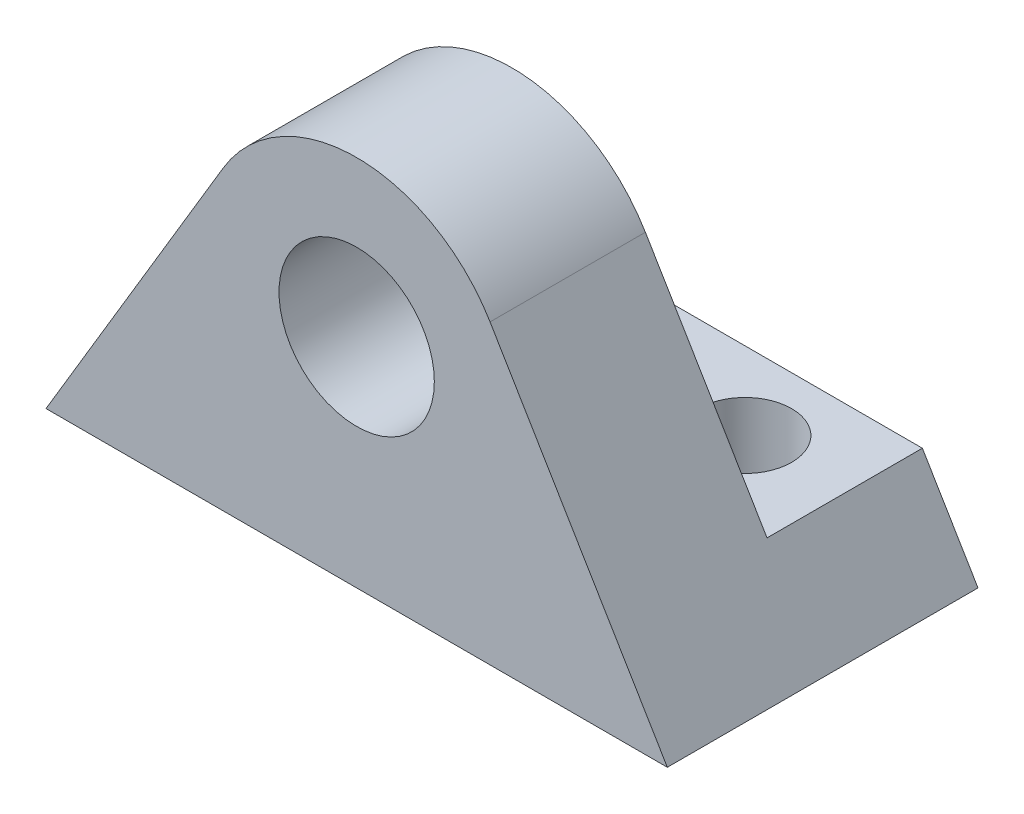
ISO-10303-21;
HEADER;
FILE_DESCRIPTION(('STEP AP214'),'2;1');
FILE_NAME('part.step','',(''),(''),'','','');
FILE_SCHEMA(('AUTOMOTIVE_DESIGN { 1 0 10303 214 1 1 1 1 }'));
ENDSEC;
DATA;
#1=APPLICATION_CONTEXT('core data for automotive mechanical design processes');
#2=APPLICATION_PROTOCOL_DEFINITION('international standard','automotive_design',2000,#1);
#3=PRODUCT_CONTEXT('',#1,'mechanical');
#4=PRODUCT('Part','Part','',(#3));
#5=PRODUCT_RELATED_PRODUCT_CATEGORY('part','',(#4));
#6=PRODUCT_DEFINITION_FORMATION('','',#4);
#7=PRODUCT_DEFINITION_CONTEXT('part definition',#1,'design');
#8=PRODUCT_DEFINITION('design','',#6,#7);
#9=PRODUCT_DEFINITION_SHAPE('','',#8);
#10=(LENGTH_UNIT() NAMED_UNIT(*) SI_UNIT(.MILLI.,.METRE.));
#11=(NAMED_UNIT(*) PLANE_ANGLE_UNIT() SI_UNIT($,.RADIAN.));
#12=(NAMED_UNIT(*) SI_UNIT($,.STERADIAN.) SOLID_ANGLE_UNIT());
#13=UNCERTAINTY_MEASURE_WITH_UNIT(LENGTH_MEASURE(1.E-05),#10,'distance_accuracy_value','');
#14=(GEOMETRIC_REPRESENTATION_CONTEXT(3) GLOBAL_UNCERTAINTY_ASSIGNED_CONTEXT((#13)) GLOBAL_UNIT_ASSIGNED_CONTEXT((#10,
#11,#12)) REPRESENTATION_CONTEXT('',''));
#15=CARTESIAN_POINT('',(0.,0.,0.));
#16=DIRECTION('',(0.,0.,1.));
#17=DIRECTION('',(1.,0.,0.));
#18=AXIS2_PLACEMENT_3D('',#15,#16,#17);
#19=CARTESIAN_POINT('',(12.7,8.89,6.35));
#20=DIRECTION('',(0.,0.,1.));
#21=DIRECTION('',(1.,0.,0.));
#22=AXIS2_PLACEMENT_3D('',#19,#20,#21);
#23=PLANE('',#22);
#24=DIRECTION('',(-0.512451592326178,-0.858716114628324,0.));
#25=VECTOR('',#24,1.);
#26=CARTESIAN_POINT('',(7.24715267211014,12.1440676112712,6.35));
#27=LINE('',#26,#25);
#28=CARTESIAN_POINT('',(7.24715267211014,12.1440676112712,6.35));
#29=VERTEX_POINT('',#28);
#30=CARTESIAN_POINT('',(0.,0.,6.35));
#31=VERTEX_POINT('',#30);
#32=EDGE_CURVE('E102',#29,#31,#27,.T.);
#33=ORIENTED_EDGE('',*,*,#32,.T.);
#34=DIRECTION('',(1.,0.,0.));
#35=VECTOR('',#34,1.);
#36=CARTESIAN_POINT('',(0.,0.,6.35));
#37=LINE('',#36,#35);
#38=CARTESIAN_POINT('',(25.4,0.,6.35));
#39=VERTEX_POINT('',#38);
#40=EDGE_CURVE('E95',#31,#39,#37,.T.);
#41=ORIENTED_EDGE('',*,*,#40,.T.);
#42=DIRECTION('',(-0.512451592326178,0.858716114628324,0.));
#43=VECTOR('',#42,1.);
#44=CARTESIAN_POINT('',(25.4,0.,6.35));
#45=LINE('',#44,#43);
#46=CARTESIAN_POINT('',(18.1528473278899,12.1440676112712,6.35));
#47=VERTEX_POINT('',#46);
#48=EDGE_CURVE('E99',#39,#47,#45,.T.);
#49=ORIENTED_EDGE('',*,*,#48,.T.);
#50=CARTESIAN_POINT('',(12.7,8.89,6.35));
#51=DIRECTION('',(0.,0.,1.));
#52=DIRECTION('',(1.,0.,0.));
#53=AXIS2_PLACEMENT_3D('',#50,#51,#52);
#54=CIRCLE('',#53,6.35);
#55=EDGE_CURVE('E64',#47,#29,#54,.T.);
#56=ORIENTED_EDGE('',*,*,#55,.T.);
#57=EDGE_LOOP('',(#33,#41,#49,#56));
#58=FACE_BOUND('',#57,.T.);
#59=CARTESIAN_POINT('',(12.7,8.89,6.35));
#60=DIRECTION('',(0.,0.,1.));
#61=DIRECTION('',(1.,0.,0.));
#62=AXIS2_PLACEMENT_3D('',#59,#60,#61);
#63=CIRCLE('',#62,3.17500000000001);
#64=CARTESIAN_POINT('',(15.875,8.89,6.35));
#65=VERTEX_POINT('',#64);
#66=EDGE_CURVE('E127',#65,#65,#63,.T.);
#67=ORIENTED_EDGE('',*,*,#66,.F.);
#68=EDGE_LOOP('',(#67));
#69=FACE_BOUND('',#68,.T.);
#70=ADVANCED_FACE('F45',(#58,#69),#23,.T.);
#71=CARTESIAN_POINT('',(12.7,8.89,-6.35));
#72=DIRECTION('',(0.,0.,1.));
#73=DIRECTION('',(1.,0.,0.));
#74=AXIS2_PLACEMENT_3D('',#71,#72,#73);
#75=PLANE('',#74);
#76=DIRECTION('',(-0.512451592326178,-0.858716114628324,0.));
#77=VECTOR('',#76,1.);
#78=CARTESIAN_POINT('',(7.24715267211014,12.1440676112712,-6.35));
#79=LINE('',#78,#77);
#80=CARTESIAN_POINT('',(2.27367407400734,3.81,-6.35));
#81=VERTEX_POINT('',#80);
#82=CARTESIAN_POINT('',(0.,0.,-6.35));
#83=VERTEX_POINT('',#82);
#84=EDGE_CURVE('E76',#81,#83,#79,.T.);
#85=ORIENTED_EDGE('',*,*,#84,.F.);
#86=DIRECTION('',(1.,0.,0.));
#87=VECTOR('',#86,1.);
#88=CARTESIAN_POINT('',(2.27367407400734,3.81,-6.35));
#89=LINE('',#88,#87);
#90=CARTESIAN_POINT('',(23.1263259259927,3.81,-6.35));
#91=VERTEX_POINT('',#90);
#92=EDGE_CURVE('E157',#81,#91,#89,.T.);
#93=ORIENTED_EDGE('',*,*,#92,.T.);
#94=DIRECTION('',(-0.512451592326178,0.858716114628324,0.));
#95=VECTOR('',#94,1.);
#96=CARTESIAN_POINT('',(25.4,0.,-6.35));
#97=LINE('',#96,#95);
#98=CARTESIAN_POINT('',(25.4,0.,-6.35));
#99=VERTEX_POINT('',#98);
#100=EDGE_CURVE('E130',#99,#91,#97,.T.);
#101=ORIENTED_EDGE('',*,*,#100,.F.);
#102=DIRECTION('',(1.,0.,0.));
#103=VECTOR('',#102,1.);
#104=CARTESIAN_POINT('',(0.,0.,-6.35));
#105=LINE('',#104,#103);
#106=EDGE_CURVE('E108',#83,#99,#105,.T.);
#107=ORIENTED_EDGE('',*,*,#106,.F.);
#108=EDGE_LOOP('',(#85,#93,#101,#107));
#109=FACE_BOUND('',#108,.T.);
#110=ADVANCED_FACE('F204',(#109),#75,.F.);
#111=CARTESIAN_POINT('',(7.24715267211014,12.1440676112712,6.35));
#112=DIRECTION('',(0.858716114628324,-0.512451592326177,0.));
#113=DIRECTION('',(0.512451592326178,0.858716114628324,0.));
#114=AXIS2_PLACEMENT_3D('',#111,#112,#113);
#115=PLANE('',#114);
#116=DIRECTION('',(-0.512451592326178,-0.858716114628324,0.));
#117=VECTOR('',#116,1.);
#118=CARTESIAN_POINT('',(7.24715267211014,12.1440676112712,0.));
#119=LINE('',#118,#117);
#120=CARTESIAN_POINT('',(7.24715267211014,12.1440676112712,0.));
#121=VERTEX_POINT('',#120);
#122=CARTESIAN_POINT('',(2.27367407400734,3.81,0.));
#123=VERTEX_POINT('',#122);
#124=EDGE_CURVE('E87',#121,#123,#119,.T.);
#125=ORIENTED_EDGE('',*,*,#124,.T.);
#126=DIRECTION('',(0.,0.,1.));
#127=VECTOR('',#126,1.);
#128=CARTESIAN_POINT('',(2.27367407400734,3.81,-6.35));
#129=LINE('',#128,#127);
#130=EDGE_CURVE('E152',#81,#123,#129,.T.);
#131=ORIENTED_EDGE('',*,*,#130,.F.);
#132=ORIENTED_EDGE('',*,*,#84,.T.);
#133=DIRECTION('',(0.,0.,-1.));
#134=VECTOR('',#133,1.);
#135=CARTESIAN_POINT('',(0.,0.,6.35));
#136=LINE('',#135,#134);
#137=EDGE_CURVE('E11',#31,#83,#136,.T.);
#138=ORIENTED_EDGE('',*,*,#137,.F.);
#139=ORIENTED_EDGE('',*,*,#32,.F.);
#140=DIRECTION('',(0.,0.,-1.));
#141=VECTOR('',#140,1.);
#142=CARTESIAN_POINT('',(7.24715267211014,12.1440676112712,6.35));
#143=LINE('',#142,#141);
#144=EDGE_CURVE('E121',#29,#121,#143,.T.);
#145=ORIENTED_EDGE('',*,*,#144,.T.);
#146=EDGE_LOOP('',(#125,#131,#132,#138,#139,#145));
#147=FACE_BOUND('',#146,.T.);
#148=ADVANCED_FACE('F47',(#147),#115,.F.);
#149=CARTESIAN_POINT('',(0.,0.,6.35));
#150=DIRECTION('',(0.,1.,0.));
#151=DIRECTION('',(0.,0.,1.));
#152=AXIS2_PLACEMENT_3D('',#149,#150,#151);
#153=PLANE('',#152);
#154=CARTESIAN_POINT('',(6.35,0.,-3.175));
#155=DIRECTION('',(0.,1.,0.));
#156=DIRECTION('',(0.,0.,1.));
#157=AXIS2_PLACEMENT_3D('',#154,#155,#156);
#158=CIRCLE('',#157,1.905);
#159=CARTESIAN_POINT('',(6.35,0.,-1.27));
#160=VERTEX_POINT('',#159);
#161=EDGE_CURVE('E165',#160,#160,#158,.T.);
#162=ORIENTED_EDGE('',*,*,#161,.T.);
#163=EDGE_LOOP('',(#162));
#164=FACE_BOUND('',#163,.T.);
#165=CARTESIAN_POINT('',(19.05,0.,-3.175));
#166=DIRECTION('',(0.,1.,0.));
#167=DIRECTION('',(0.,0.,1.));
#168=AXIS2_PLACEMENT_3D('',#165,#166,#167);
#169=CIRCLE('',#168,1.905);
#170=CARTESIAN_POINT('',(19.05,0.,-1.27));
#171=VERTEX_POINT('',#170);
#172=EDGE_CURVE('E172',#171,#171,#169,.T.);
#173=ORIENTED_EDGE('',*,*,#172,.T.);
#174=EDGE_LOOP('',(#173));
#175=FACE_BOUND('',#174,.T.);
#176=ORIENTED_EDGE('',*,*,#106,.T.);
#177=DIRECTION('',(0.,0.,-1.));
#178=VECTOR('',#177,1.);
#179=CARTESIAN_POINT('',(25.4,0.,6.35));
#180=LINE('',#179,#178);
#181=EDGE_CURVE('E56',#39,#99,#180,.T.);
#182=ORIENTED_EDGE('',*,*,#181,.F.);
#183=ORIENTED_EDGE('',*,*,#40,.F.);
#184=ORIENTED_EDGE('',*,*,#137,.T.);
#185=EDGE_LOOP('',(#176,#182,#183,#184));
#186=FACE_BOUND('',#185,.T.);
#187=ADVANCED_FACE('F107',(#164,#175,#186),#153,.F.);
#188=CARTESIAN_POINT('',(25.4,0.,6.35));
#189=DIRECTION('',(-0.858716114628324,-0.512451592326178,0.));
#190=DIRECTION('',(0.512451592326178,-0.858716114628324,0.));
#191=AXIS2_PLACEMENT_3D('',#188,#189,#190);
#192=PLANE('',#191);
#193=ORIENTED_EDGE('',*,*,#100,.T.);
#194=DIRECTION('',(0.,0.,1.));
#195=VECTOR('',#194,1.);
#196=CARTESIAN_POINT('',(23.1263259259927,3.81,-6.35));
#197=LINE('',#196,#195);
#198=CARTESIAN_POINT('',(23.1263259259927,3.81,0.));
#199=VERTEX_POINT('',#198);
#200=EDGE_CURVE('E156',#91,#199,#197,.T.);
#201=ORIENTED_EDGE('',*,*,#200,.T.);
#202=DIRECTION('',(-0.512451592326178,0.858716114628324,0.));
#203=VECTOR('',#202,1.);
#204=CARTESIAN_POINT('',(25.4,0.,0.));
#205=LINE('',#204,#203);
#206=CARTESIAN_POINT('',(18.1528473278899,12.1440676112712,0.));
#207=VERTEX_POINT('',#206);
#208=EDGE_CURVE('E147',#199,#207,#205,.T.);
#209=ORIENTED_EDGE('',*,*,#208,.T.);
#210=DIRECTION('',(0.,0.,-1.));
#211=VECTOR('',#210,1.);
#212=CARTESIAN_POINT('',(18.1528473278899,12.1440676112712,6.35));
#213=LINE('',#212,#211);
#214=EDGE_CURVE('E113',#47,#207,#213,.T.);
#215=ORIENTED_EDGE('',*,*,#214,.F.);
#216=ORIENTED_EDGE('',*,*,#48,.F.);
#217=ORIENTED_EDGE('',*,*,#181,.T.);
#218=EDGE_LOOP('',(#193,#201,#209,#215,#216,#217));
#219=FACE_BOUND('',#218,.T.);
#220=ADVANCED_FACE('F115',(#219),#192,.F.);
#221=CARTESIAN_POINT('',(12.7,8.89,6.35));
#222=DIRECTION('',(0.,0.,-1.));
#223=DIRECTION('',(-1.,0.,0.));
#224=AXIS2_PLACEMENT_3D('',#221,#222,#223);
#225=CYLINDRICAL_SURFACE('',#224,6.35);
#226=ORIENTED_EDGE('',*,*,#214,.T.);
#227=CARTESIAN_POINT('',(12.7,8.89,0.));
#228=DIRECTION('',(0.,0.,1.));
#229=DIRECTION('',(1.,0.,0.));
#230=AXIS2_PLACEMENT_3D('',#227,#228,#229);
#231=CIRCLE('',#230,6.35);
#232=EDGE_CURVE('E139',#207,#121,#231,.T.);
#233=ORIENTED_EDGE('',*,*,#232,.T.);
#234=ORIENTED_EDGE('',*,*,#144,.F.);
#235=ORIENTED_EDGE('',*,*,#55,.F.);
#236=EDGE_LOOP('',(#226,#233,#234,#235));
#237=FACE_BOUND('',#236,.T.);
#238=ADVANCED_FACE('F138',(#237),#225,.T.);
#239=CARTESIAN_POINT('',(12.7,8.89,6.35));
#240=DIRECTION('',(0.,0.,-1.));
#241=DIRECTION('',(-1.,0.,0.));
#242=AXIS2_PLACEMENT_3D('',#239,#240,#241);
#243=CYLINDRICAL_SURFACE('',#242,3.17500000000001);
#244=CARTESIAN_POINT('',(12.7,8.89,0.));
#245=DIRECTION('',(0.,0.,1.));
#246=DIRECTION('',(1.,0.,0.));
#247=AXIS2_PLACEMENT_3D('',#244,#245,#246);
#248=CIRCLE('',#247,3.17500000000001);
#249=CARTESIAN_POINT('',(15.875,8.89,0.));
#250=VERTEX_POINT('',#249);
#251=EDGE_CURVE('E49',#250,#250,#248,.T.);
#252=ORIENTED_EDGE('',*,*,#251,.F.);
#253=EDGE_LOOP('',(#252));
#254=FACE_BOUND('',#253,.T.);
#255=ORIENTED_EDGE('',*,*,#66,.T.);
#256=EDGE_LOOP('',(#255));
#257=FACE_BOUND('',#256,.T.);
#258=ADVANCED_FACE('F218',(#254,#257),#243,.F.);
#259=CARTESIAN_POINT('',(0.,0.,0.));
#260=DIRECTION('',(0.,0.,1.));
#261=DIRECTION('',(1.,0.,0.));
#262=AXIS2_PLACEMENT_3D('',#259,#260,#261);
#263=PLANE('',#262);
#264=ORIENTED_EDGE('',*,*,#251,.T.);
#265=EDGE_LOOP('',(#264));
#266=FACE_BOUND('',#265,.T.);
#267=ORIENTED_EDGE('',*,*,#232,.F.);
#268=ORIENTED_EDGE('',*,*,#208,.F.);
#269=DIRECTION('',(1.,0.,0.));
#270=VECTOR('',#269,1.);
#271=CARTESIAN_POINT('',(2.27367407400734,3.81,0.));
#272=LINE('',#271,#270);
#273=EDGE_CURVE('E161',#123,#199,#272,.T.);
#274=ORIENTED_EDGE('',*,*,#273,.F.);
#275=ORIENTED_EDGE('',*,*,#124,.F.);
#276=EDGE_LOOP('',(#267,#268,#274,#275));
#277=FACE_BOUND('',#276,.T.);
#278=ADVANCED_FACE('F192',(#266,#277),#263,.F.);
#279=CARTESIAN_POINT('',(2.27367407400734,3.81,-6.35));
#280=DIRECTION('',(0.,-1.,0.));
#281=DIRECTION('',(1.,0.,0.));
#282=AXIS2_PLACEMENT_3D('',#279,#280,#281);
#283=PLANE('',#282);
#284=CARTESIAN_POINT('',(6.35,3.81,-3.175));
#285=DIRECTION('',(0.,1.,0.));
#286=DIRECTION('',(0.,0.,1.));
#287=AXIS2_PLACEMENT_3D('',#284,#285,#286);
#288=CIRCLE('',#287,1.905);
#289=CARTESIAN_POINT('',(6.35,3.81,-1.27));
#290=VERTEX_POINT('',#289);
#291=EDGE_CURVE('E176',#290,#290,#288,.T.);
#292=ORIENTED_EDGE('',*,*,#291,.F.);
#293=EDGE_LOOP('',(#292));
#294=FACE_BOUND('',#293,.T.);
#295=CARTESIAN_POINT('',(19.05,3.81,-3.175));
#296=DIRECTION('',(0.,1.,0.));
#297=DIRECTION('',(0.,0.,-1.));
#298=AXIS2_PLACEMENT_3D('',#295,#296,#297);
#299=CIRCLE('',#298,1.905);
#300=CARTESIAN_POINT('',(19.05,3.81,-5.08));
#301=VERTEX_POINT('',#300);
#302=EDGE_CURVE('E177',#301,#301,#299,.T.);
#303=ORIENTED_EDGE('',*,*,#302,.F.);
#304=EDGE_LOOP('',(#303));
#305=FACE_BOUND('',#304,.T.);
#306=ORIENTED_EDGE('',*,*,#273,.T.);
#307=ORIENTED_EDGE('',*,*,#200,.F.);
#308=ORIENTED_EDGE('',*,*,#92,.F.);
#309=ORIENTED_EDGE('',*,*,#130,.T.);
#310=EDGE_LOOP('',(#306,#307,#308,#309));
#311=FACE_BOUND('',#310,.T.);
#312=ADVANCED_FACE('F188',(#294,#305,#311),#283,.F.);
#313=CARTESIAN_POINT('',(19.05,-2.54,-3.175));
#314=DIRECTION('',(0.,1.,0.));
#315=DIRECTION('',(0.,0.,1.));
#316=AXIS2_PLACEMENT_3D('',#313,#314,#315);
#317=CYLINDRICAL_SURFACE('',#316,1.905);
#318=ORIENTED_EDGE('',*,*,#302,.T.);
#319=EDGE_LOOP('',(#318));
#320=FACE_BOUND('',#319,.T.);
#321=ORIENTED_EDGE('',*,*,#172,.F.);
#322=EDGE_LOOP('',(#321));
#323=FACE_BOUND('',#322,.T.);
#324=ADVANCED_FACE('F191',(#320,#323),#317,.F.);
#325=CARTESIAN_POINT('',(6.35,-2.54,-3.175));
#326=DIRECTION('',(0.,1.,0.));
#327=DIRECTION('',(0.,0.,1.));
#328=AXIS2_PLACEMENT_3D('',#325,#326,#327);
#329=CYLINDRICAL_SURFACE('',#328,1.905);
#330=ORIENTED_EDGE('',*,*,#291,.T.);
#331=EDGE_LOOP('',(#330));
#332=FACE_BOUND('',#331,.T.);
#333=ORIENTED_EDGE('',*,*,#161,.F.);
#334=EDGE_LOOP('',(#333));
#335=FACE_BOUND('',#334,.T.);
#336=ADVANCED_FACE('F185',(#332,#335),#329,.F.);
#337=CLOSED_SHELL('',(#70,#110,#148,#187,#220,#238,#258,#278,#312,#324,#336));
#338=MANIFOLD_SOLID_BREP('B2',#337);
#339=ADVANCED_BREP_SHAPE_REPRESENTATION('',(#18,#338),#14);
#340=SHAPE_DEFINITION_REPRESENTATION(#9,#339);
ENDSEC;
END-ISO-10303-21;
